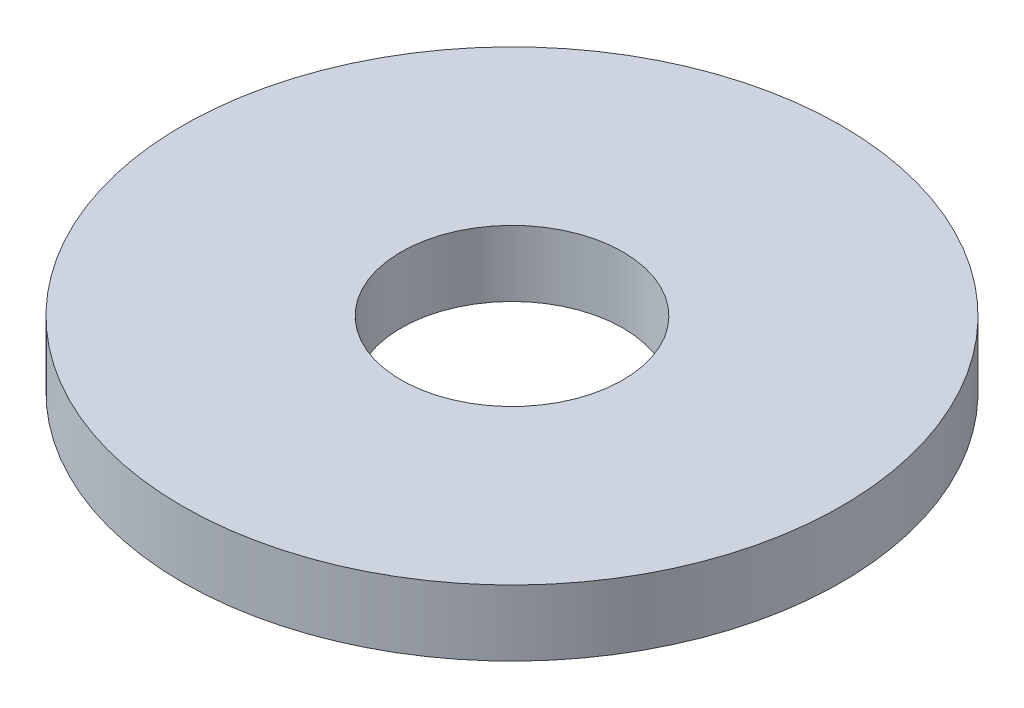
ISO-10303-21;
HEADER;
FILE_DESCRIPTION(('STEP AP214'),'2;1');
FILE_NAME('part.step','',(''),(''),'','','');
FILE_SCHEMA(('AUTOMOTIVE_DESIGN { 1 0 10303 214 1 1 1 1 }'));
ENDSEC;
DATA;
#1=APPLICATION_CONTEXT('core data for automotive mechanical design processes');
#2=APPLICATION_PROTOCOL_DEFINITION('international standard','automotive_design',2000,#1);
#3=PRODUCT_CONTEXT('',#1,'mechanical');
#4=PRODUCT('Part','Part','',(#3));
#5=PRODUCT_RELATED_PRODUCT_CATEGORY('part','',(#4));
#6=PRODUCT_DEFINITION_FORMATION('','',#4);
#7=PRODUCT_DEFINITION_CONTEXT('part definition',#1,'design');
#8=PRODUCT_DEFINITION('design','',#6,#7);
#9=PRODUCT_DEFINITION_SHAPE('','',#8);
#10=(LENGTH_UNIT() NAMED_UNIT(*) SI_UNIT(.MILLI.,.METRE.));
#11=(NAMED_UNIT(*) PLANE_ANGLE_UNIT() SI_UNIT($,.RADIAN.));
#12=(NAMED_UNIT(*) SI_UNIT($,.STERADIAN.) SOLID_ANGLE_UNIT());
#13=UNCERTAINTY_MEASURE_WITH_UNIT(LENGTH_MEASURE(1.E-05),#10,'distance_accuracy_value','');
#14=(GEOMETRIC_REPRESENTATION_CONTEXT(3) GLOBAL_UNCERTAINTY_ASSIGNED_CONTEXT((#13)) GLOBAL_UNIT_ASSIGNED_CONTEXT((#10,
#11,#12)) REPRESENTATION_CONTEXT('',''));
#15=CARTESIAN_POINT('',(0.,0.,0.));
#16=DIRECTION('',(0.,0.,1.));
#17=DIRECTION('',(1.,0.,0.));
#18=AXIS2_PLACEMENT_3D('',#15,#16,#17);
#19=CARTESIAN_POINT('',(0.,0.3,0.));
#20=DIRECTION('',(0.,-1.,0.));
#21=DIRECTION('',(0.,0.,-1.));
#22=AXIS2_PLACEMENT_3D('',#19,#20,#21);
#23=CYLINDRICAL_SURFACE('',#22,1.5);
#24=CARTESIAN_POINT('',(0.,0.3,0.));
#25=DIRECTION('',(0.,1.,0.));
#26=DIRECTION('',(0.,0.,1.));
#27=AXIS2_PLACEMENT_3D('',#24,#25,#26);
#28=CIRCLE('',#27,1.5);
#29=CARTESIAN_POINT('',(0.,0.3,1.5));
#30=VERTEX_POINT('',#29);
#31=EDGE_CURVE('E10',#30,#30,#28,.T.);
#32=ORIENTED_EDGE('',*,*,#31,.F.);
#33=EDGE_LOOP('',(#32));
#34=FACE_BOUND('',#33,.T.);
#35=CARTESIAN_POINT('',(0.,0.,0.));
#36=DIRECTION('',(0.,1.,0.));
#37=DIRECTION('',(0.,0.,1.));
#38=AXIS2_PLACEMENT_3D('',#35,#36,#37);
#39=CIRCLE('',#38,1.5);
#40=CARTESIAN_POINT('',(0.,0.,1.5));
#41=VERTEX_POINT('',#40);
#42=EDGE_CURVE('E33',#41,#41,#39,.T.);
#43=ORIENTED_EDGE('',*,*,#42,.T.);
#44=EDGE_LOOP('',(#43));
#45=FACE_BOUND('',#44,.T.);
#46=ADVANCED_FACE('F30',(#34,#45),#23,.T.);
#47=CARTESIAN_POINT('',(0.,0.3,0.));
#48=DIRECTION('',(0.,1.,0.));
#49=DIRECTION('',(0.,0.,1.));
#50=AXIS2_PLACEMENT_3D('',#47,#48,#49);
#51=PLANE('',#50);
#52=CARTESIAN_POINT('',(0.,0.3,0.));
#53=DIRECTION('',(0.,-1.,0.));
#54=DIRECTION('',(0.,0.,-1.));
#55=AXIS2_PLACEMENT_3D('',#52,#53,#54);
#56=CIRCLE('',#55,0.505);
#57=CARTESIAN_POINT('',(0.,0.3,-0.505));
#58=VERTEX_POINT('',#57);
#59=EDGE_CURVE('E40',#58,#58,#56,.T.);
#60=ORIENTED_EDGE('',*,*,#59,.T.);
#61=EDGE_LOOP('',(#60));
#62=FACE_BOUND('',#61,.T.);
#63=ORIENTED_EDGE('',*,*,#31,.T.);
#64=EDGE_LOOP('',(#63));
#65=FACE_BOUND('',#64,.T.);
#66=ADVANCED_FACE('F48',(#62,#65),#51,.T.);
#67=CARTESIAN_POINT('',(0.,0.,0.));
#68=DIRECTION('',(0.,1.,0.));
#69=DIRECTION('',(0.,0.,1.));
#70=AXIS2_PLACEMENT_3D('',#67,#68,#69);
#71=PLANE('',#70);
#72=CARTESIAN_POINT('',(0.,0.,0.));
#73=DIRECTION('',(0.,-1.,0.));
#74=DIRECTION('',(0.,0.,-1.));
#75=AXIS2_PLACEMENT_3D('',#72,#73,#74);
#76=CIRCLE('',#75,0.505);
#77=CARTESIAN_POINT('',(0.,0.,-0.505));
#78=VERTEX_POINT('',#77);
#79=EDGE_CURVE('E42',#78,#78,#76,.T.);
#80=ORIENTED_EDGE('',*,*,#79,.F.);
#81=EDGE_LOOP('',(#80));
#82=FACE_BOUND('',#81,.T.);
#83=ORIENTED_EDGE('',*,*,#42,.F.);
#84=EDGE_LOOP('',(#83));
#85=FACE_BOUND('',#84,.T.);
#86=ADVANCED_FACE('F53',(#82,#85),#71,.F.);
#87=CARTESIAN_POINT('',(0.,0.3,0.));
#88=DIRECTION('',(0.,-1.,0.));
#89=DIRECTION('',(0.,0.,-1.));
#90=AXIS2_PLACEMENT_3D('',#87,#88,#89);
#91=CYLINDRICAL_SURFACE('',#90,0.505);
#92=ORIENTED_EDGE('',*,*,#59,.F.);
#93=EDGE_LOOP('',(#92));
#94=FACE_BOUND('',#93,.T.);
#95=ORIENTED_EDGE('',*,*,#79,.T.);
#96=EDGE_LOOP('',(#95));
#97=FACE_BOUND('',#96,.T.);
#98=ADVANCED_FACE('F50',(#94,#97),#91,.F.);
#99=CLOSED_SHELL('',(#46,#66,#86,#98));
#100=MANIFOLD_SOLID_BREP('B2',#99);
#101=ADVANCED_BREP_SHAPE_REPRESENTATION('',(#18,#100),#14);
#102=SHAPE_DEFINITION_REPRESENTATION(#9,#101);
ENDSEC;
END-ISO-10303-21;
